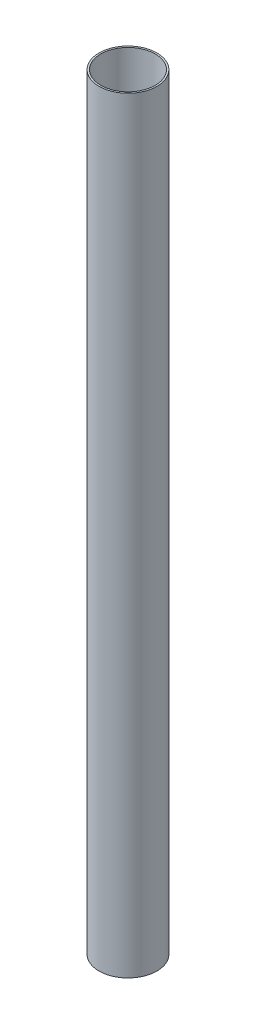
ISO-10303-21;
HEADER;
FILE_DESCRIPTION(('STEP AP214'),'2;1');
FILE_NAME('part.step','',(''),(''),'','','');
FILE_SCHEMA(('AUTOMOTIVE_DESIGN { 1 0 10303 214 1 1 1 1 }'));
ENDSEC;
DATA;
#1=APPLICATION_CONTEXT('core data for automotive mechanical design processes');
#2=APPLICATION_PROTOCOL_DEFINITION('international standard','automotive_design',2000,#1);
#3=PRODUCT_CONTEXT('',#1,'mechanical');
#4=PRODUCT('Part','Part','',(#3));
#5=PRODUCT_RELATED_PRODUCT_CATEGORY('part','',(#4));
#6=PRODUCT_DEFINITION_FORMATION('','',#4);
#7=PRODUCT_DEFINITION_CONTEXT('part definition',#1,'design');
#8=PRODUCT_DEFINITION('design','',#6,#7);
#9=PRODUCT_DEFINITION_SHAPE('','',#8);
#10=(LENGTH_UNIT() NAMED_UNIT(*) SI_UNIT(.MILLI.,.METRE.));
#11=(NAMED_UNIT(*) PLANE_ANGLE_UNIT() SI_UNIT($,.RADIAN.));
#12=(NAMED_UNIT(*) SI_UNIT($,.STERADIAN.) SOLID_ANGLE_UNIT());
#13=UNCERTAINTY_MEASURE_WITH_UNIT(LENGTH_MEASURE(1.E-05),#10,'distance_accuracy_value','');
#14=(GEOMETRIC_REPRESENTATION_CONTEXT(3) GLOBAL_UNCERTAINTY_ASSIGNED_CONTEXT((#13)) GLOBAL_UNIT_ASSIGNED_CONTEXT((#10,
#11,#12)) REPRESENTATION_CONTEXT('',''));
#15=CARTESIAN_POINT('',(0.,0.,0.));
#16=DIRECTION('',(0.,0.,1.));
#17=DIRECTION('',(1.,0.,0.));
#18=AXIS2_PLACEMENT_3D('',#15,#16,#17);
#19=CARTESIAN_POINT('',(0.,450.,0.));
#20=DIRECTION('',(0.,1.,0.));
#21=DIRECTION('',(0.,0.,1.));
#22=AXIS2_PLACEMENT_3D('',#19,#20,#21);
#23=PLANE('',#22);
#24=CARTESIAN_POINT('',(0.,450.,0.));
#25=DIRECTION('',(0.,1.,0.));
#26=DIRECTION('',(0.,0.,1.));
#27=AXIS2_PLACEMENT_3D('',#24,#25,#26);
#28=CIRCLE('',#27,17.);
#29=CARTESIAN_POINT('',(0.,450.,17.));
#30=VERTEX_POINT('',#29);
#31=EDGE_CURVE('E10',#30,#30,#28,.T.);
#32=ORIENTED_EDGE('',*,*,#31,.T.);
#33=EDGE_LOOP('',(#32));
#34=FACE_BOUND('',#33,.T.);
#35=CARTESIAN_POINT('',(0.,450.,0.));
#36=DIRECTION('',(0.,1.,0.));
#37=DIRECTION('',(0.,0.,1.));
#38=AXIS2_PLACEMENT_3D('',#35,#36,#37);
#39=CIRCLE('',#38,16.);
#40=CARTESIAN_POINT('',(0.,450.,16.));
#41=VERTEX_POINT('',#40);
#42=EDGE_CURVE('E45',#41,#41,#39,.T.);
#43=ORIENTED_EDGE('',*,*,#42,.F.);
#44=EDGE_LOOP('',(#43));
#45=FACE_BOUND('',#44,.T.);
#46=ADVANCED_FACE('F34',(#34,#45),#23,.T.);
#47=CARTESIAN_POINT('',(0.,0.,0.));
#48=DIRECTION('',(0.,1.,0.));
#49=DIRECTION('',(0.,0.,1.));
#50=AXIS2_PLACEMENT_3D('',#47,#48,#49);
#51=PLANE('',#50);
#52=CARTESIAN_POINT('',(0.,0.,0.));
#53=DIRECTION('',(0.,1.,0.));
#54=DIRECTION('',(0.,0.,1.));
#55=AXIS2_PLACEMENT_3D('',#52,#53,#54);
#56=CIRCLE('',#55,17.);
#57=CARTESIAN_POINT('',(0.,0.,17.));
#58=VERTEX_POINT('',#57);
#59=EDGE_CURVE('E38',#58,#58,#56,.T.);
#60=ORIENTED_EDGE('',*,*,#59,.F.);
#61=EDGE_LOOP('',(#60));
#62=FACE_BOUND('',#61,.T.);
#63=CARTESIAN_POINT('',(0.,0.,0.));
#64=DIRECTION('',(0.,1.,0.));
#65=DIRECTION('',(0.,0.,1.));
#66=AXIS2_PLACEMENT_3D('',#63,#64,#65);
#67=CIRCLE('',#66,16.);
#68=CARTESIAN_POINT('',(0.,0.,16.));
#69=VERTEX_POINT('',#68);
#70=EDGE_CURVE('E47',#69,#69,#67,.T.);
#71=ORIENTED_EDGE('',*,*,#70,.T.);
#72=EDGE_LOOP('',(#71));
#73=FACE_BOUND('',#72,.T.);
#74=ADVANCED_FACE('F57',(#62,#73),#51,.F.);
#75=CARTESIAN_POINT('',(0.,450.,0.));
#76=DIRECTION('',(0.,-1.,0.));
#77=DIRECTION('',(0.,0.,-1.));
#78=AXIS2_PLACEMENT_3D('',#75,#76,#77);
#79=CYLINDRICAL_SURFACE('',#78,17.);
#80=ORIENTED_EDGE('',*,*,#31,.F.);
#81=EDGE_LOOP('',(#80));
#82=FACE_BOUND('',#81,.T.);
#83=ORIENTED_EDGE('',*,*,#59,.T.);
#84=EDGE_LOOP('',(#83));
#85=FACE_BOUND('',#84,.T.);
#86=ADVANCED_FACE('F36',(#82,#85),#79,.T.);
#87=CARTESIAN_POINT('',(0.,450.,0.));
#88=DIRECTION('',(0.,-1.,0.));
#89=DIRECTION('',(0.,0.,-1.));
#90=AXIS2_PLACEMENT_3D('',#87,#88,#89);
#91=CYLINDRICAL_SURFACE('',#90,16.);
#92=ORIENTED_EDGE('',*,*,#42,.T.);
#93=EDGE_LOOP('',(#92));
#94=FACE_BOUND('',#93,.T.);
#95=ORIENTED_EDGE('',*,*,#70,.F.);
#96=EDGE_LOOP('',(#95));
#97=FACE_BOUND('',#96,.T.);
#98=ADVANCED_FACE('F53',(#94,#97),#91,.F.);
#99=CLOSED_SHELL('',(#46,#74,#86,#98));
#100=MANIFOLD_SOLID_BREP('B2',#99);
#101=ADVANCED_BREP_SHAPE_REPRESENTATION('',(#18,#100),#14);
#102=SHAPE_DEFINITION_REPRESENTATION(#9,#101);
ENDSEC;
END-ISO-10303-21;
